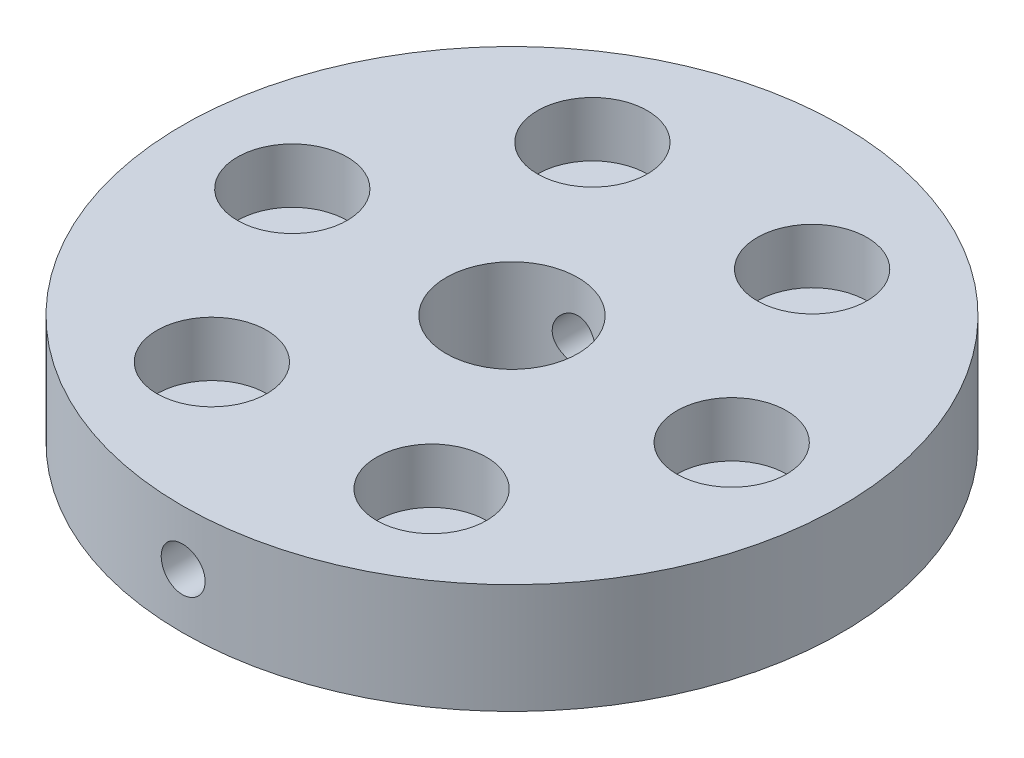
ISO-10303-21;
HEADER;
FILE_DESCRIPTION(('STEP AP214'),'2;1');
FILE_NAME('part.step','',(''),(''),'','','');
FILE_SCHEMA(('AUTOMOTIVE_DESIGN { 1 0 10303 214 1 1 1 1 }'));
ENDSEC;
DATA;
#1=APPLICATION_CONTEXT('core data for automotive mechanical design processes');
#2=APPLICATION_PROTOCOL_DEFINITION('international standard','automotive_design',2000,#1);
#3=PRODUCT_CONTEXT('',#1,'mechanical');
#4=PRODUCT('Part','Part','',(#3));
#5=PRODUCT_RELATED_PRODUCT_CATEGORY('part','',(#4));
#6=PRODUCT_DEFINITION_FORMATION('','',#4);
#7=PRODUCT_DEFINITION_CONTEXT('part definition',#1,'design');
#8=PRODUCT_DEFINITION('design','',#6,#7);
#9=PRODUCT_DEFINITION_SHAPE('','',#8);
#10=(LENGTH_UNIT() NAMED_UNIT(*) SI_UNIT(.MILLI.,.METRE.));
#11=(NAMED_UNIT(*) PLANE_ANGLE_UNIT() SI_UNIT($,.RADIAN.));
#12=(NAMED_UNIT(*) SI_UNIT($,.STERADIAN.) SOLID_ANGLE_UNIT());
#13=UNCERTAINTY_MEASURE_WITH_UNIT(LENGTH_MEASURE(1.E-05),#10,'distance_accuracy_value','');
#14=(GEOMETRIC_REPRESENTATION_CONTEXT(3) GLOBAL_UNCERTAINTY_ASSIGNED_CONTEXT((#13)) GLOBAL_UNIT_ASSIGNED_CONTEXT((#10,
#11,#12)) REPRESENTATION_CONTEXT('',''));
#15=CARTESIAN_POINT('',(0.,0.,0.));
#16=DIRECTION('',(0.,0.,1.));
#17=DIRECTION('',(1.,0.,0.));
#18=AXIS2_PLACEMENT_3D('',#15,#16,#17);
#19=CARTESIAN_POINT('',(20.,10.,0.));
#20=DIRECTION('',(0.,-1.,0.));
#21=DIRECTION('',(0.,0.,-1.));
#22=AXIS2_PLACEMENT_3D('',#19,#20,#21);
#23=CYLINDRICAL_SURFACE('',#22,2.);
#24=CARTESIAN_POINT('',(20.,0.,0.));
#25=DIRECTION('',(0.,1.,0.));
#26=DIRECTION('',(0.,0.,1.));
#27=AXIS2_PLACEMENT_3D('',#24,#25,#26);
#28=CIRCLE('',#27,2.);
#29=CARTESIAN_POINT('',(20.,0.,2.));
#30=VERTEX_POINT('',#29);
#31=EDGE_CURVE('E45',#30,#30,#28,.T.);
#32=ORIENTED_EDGE('',*,*,#31,.F.);
#33=EDGE_LOOP('',(#32));
#34=FACE_BOUND('',#33,.T.);
#35=CARTESIAN_POINT('',(20.,5.,0.));
#36=DIRECTION('',(0.,1.,0.));
#37=DIRECTION('',(0.,0.,1.));
#38=AXIS2_PLACEMENT_3D('',#35,#36,#37);
#39=CIRCLE('',#38,2.);
#40=CARTESIAN_POINT('',(20.,5.,2.));
#41=VERTEX_POINT('',#40);
#42=EDGE_CURVE('E36',#41,#41,#39,.T.);
#43=ORIENTED_EDGE('',*,*,#42,.T.);
#44=EDGE_LOOP('',(#43));
#45=FACE_BOUND('',#44,.T.);
#46=ADVANCED_FACE('F31',(#34,#45),#23,.F.);
#47=CARTESIAN_POINT('',(9.99999999999996,10.,17.3205080756888));
#48=DIRECTION('',(0.,-1.,0.));
#49=DIRECTION('',(0.,0.,-1.));
#50=AXIS2_PLACEMENT_3D('',#47,#48,#49);
#51=CYLINDRICAL_SURFACE('',#50,2.);
#52=CARTESIAN_POINT('',(9.99999999999996,0.,17.3205080756888));
#53=DIRECTION('',(0.,1.,0.));
#54=DIRECTION('',(0.,0.,1.));
#55=AXIS2_PLACEMENT_3D('',#52,#53,#54);
#56=CIRCLE('',#55,2.);
#57=CARTESIAN_POINT('',(9.99999999999996,0.,19.3205080756888));
#58=VERTEX_POINT('',#57);
#59=EDGE_CURVE('E106',#58,#58,#56,.T.);
#60=ORIENTED_EDGE('',*,*,#59,.F.);
#61=EDGE_LOOP('',(#60));
#62=FACE_BOUND('',#61,.T.);
#63=CARTESIAN_POINT('',(9.99999999999996,5.,17.3205080756888));
#64=DIRECTION('',(0.,1.,0.));
#65=DIRECTION('',(0.,0.,1.));
#66=AXIS2_PLACEMENT_3D('',#63,#64,#65);
#67=CIRCLE('',#66,2.);
#68=CARTESIAN_POINT('',(9.99999999999996,5.,19.3205080756888));
#69=VERTEX_POINT('',#68);
#70=EDGE_CURVE('E367',#69,#69,#67,.T.);
#71=ORIENTED_EDGE('',*,*,#70,.T.);
#72=EDGE_LOOP('',(#71));
#73=FACE_BOUND('',#72,.T.);
#74=ADVANCED_FACE('F129',(#62,#73),#51,.F.);
#75=CARTESIAN_POINT('',(-10.0000000000001,10.,17.3205080756887));
#76=DIRECTION('',(0.,-1.,0.));
#77=DIRECTION('',(0.,0.,-1.));
#78=AXIS2_PLACEMENT_3D('',#75,#76,#77);
#79=CYLINDRICAL_SURFACE('',#78,2.);
#80=CARTESIAN_POINT('',(-10.0000000000001,0.,17.3205080756887));
#81=DIRECTION('',(0.,1.,0.));
#82=DIRECTION('',(0.,0.,1.));
#83=AXIS2_PLACEMENT_3D('',#80,#81,#82);
#84=CIRCLE('',#83,2.);
#85=CARTESIAN_POINT('',(-10.0000000000001,0.,19.3205080756887));
#86=VERTEX_POINT('',#85);
#87=EDGE_CURVE('E103',#86,#86,#84,.T.);
#88=ORIENTED_EDGE('',*,*,#87,.F.);
#89=EDGE_LOOP('',(#88));
#90=FACE_BOUND('',#89,.T.);
#91=CARTESIAN_POINT('',(-10.0000000000001,5.,17.3205080756887));
#92=DIRECTION('',(0.,1.,0.));
#93=DIRECTION('',(0.,0.,1.));
#94=AXIS2_PLACEMENT_3D('',#91,#92,#93);
#95=CIRCLE('',#94,2.);
#96=CARTESIAN_POINT('',(-10.0000000000001,5.,19.3205080756887));
#97=VERTEX_POINT('',#96);
#98=EDGE_CURVE('E369',#97,#97,#95,.T.);
#99=ORIENTED_EDGE('',*,*,#98,.T.);
#100=EDGE_LOOP('',(#99));
#101=FACE_BOUND('',#100,.T.);
#102=ADVANCED_FACE('F134',(#90,#101),#79,.F.);
#103=CARTESIAN_POINT('',(-20.,10.,-1.39659253553725E-13));
#104=DIRECTION('',(0.,-1.,0.));
#105=DIRECTION('',(0.,0.,-1.));
#106=AXIS2_PLACEMENT_3D('',#103,#104,#105);
#107=CYLINDRICAL_SURFACE('',#106,2.);
#108=CARTESIAN_POINT('',(-20.,0.,-1.39659253553725E-13));
#109=DIRECTION('',(0.,1.,0.));
#110=DIRECTION('',(0.,0.,1.));
#111=AXIS2_PLACEMENT_3D('',#108,#109,#110);
#112=CIRCLE('',#111,2.);
#113=CARTESIAN_POINT('',(-20.,0.,1.99999999999986));
#114=VERTEX_POINT('',#113);
#115=EDGE_CURVE('E100',#114,#114,#112,.T.);
#116=ORIENTED_EDGE('',*,*,#115,.F.);
#117=EDGE_LOOP('',(#116));
#118=FACE_BOUND('',#117,.T.);
#119=CARTESIAN_POINT('',(-20.,5.,-1.39659253553725E-13));
#120=DIRECTION('',(0.,1.,0.));
#121=DIRECTION('',(0.,0.,1.));
#122=AXIS2_PLACEMENT_3D('',#119,#120,#121);
#123=CIRCLE('',#122,2.);
#124=CARTESIAN_POINT('',(-20.,5.,1.99999999999986));
#125=VERTEX_POINT('',#124);
#126=EDGE_CURVE('E373',#125,#125,#123,.T.);
#127=ORIENTED_EDGE('',*,*,#126,.T.);
#128=EDGE_LOOP('',(#127));
#129=FACE_BOUND('',#128,.T.);
#130=ADVANCED_FACE('F196',(#118,#129),#107,.F.);
#131=CARTESIAN_POINT('',(10.0000000000002,10.,-17.3205080756887));
#132=DIRECTION('',(0.,-1.,0.));
#133=DIRECTION('',(0.,0.,-1.));
#134=AXIS2_PLACEMENT_3D('',#131,#132,#133);
#135=CYLINDRICAL_SURFACE('',#134,2.);
#136=CARTESIAN_POINT('',(10.0000000000002,0.,-17.3205080756887));
#137=DIRECTION('',(0.,1.,0.));
#138=DIRECTION('',(0.,0.,1.));
#139=AXIS2_PLACEMENT_3D('',#136,#137,#138);
#140=CIRCLE('',#139,2.);
#141=CARTESIAN_POINT('',(10.0000000000002,0.,-15.3205080756887));
#142=VERTEX_POINT('',#141);
#143=EDGE_CURVE('E94',#142,#142,#140,.T.);
#144=ORIENTED_EDGE('',*,*,#143,.F.);
#145=EDGE_LOOP('',(#144));
#146=FACE_BOUND('',#145,.T.);
#147=CARTESIAN_POINT('',(10.0000000000002,5.,-17.3205080756887));
#148=DIRECTION('',(0.,1.,0.));
#149=DIRECTION('',(0.,0.,1.));
#150=AXIS2_PLACEMENT_3D('',#147,#148,#149);
#151=CIRCLE('',#150,2.);
#152=CARTESIAN_POINT('',(10.0000000000002,5.,-15.3205080756887));
#153=VERTEX_POINT('',#152);
#154=EDGE_CURVE('E378',#153,#153,#151,.T.);
#155=ORIENTED_EDGE('',*,*,#154,.T.);
#156=EDGE_LOOP('',(#155));
#157=FACE_BOUND('',#156,.T.);
#158=ADVANCED_FACE('F75',(#146,#157),#135,.F.);
#159=CARTESIAN_POINT('',(-9.99999999999984,10.,-17.3205080756889));
#160=DIRECTION('',(0.,-1.,0.));
#161=DIRECTION('',(0.,0.,-1.));
#162=AXIS2_PLACEMENT_3D('',#159,#160,#161);
#163=CYLINDRICAL_SURFACE('',#162,2.);
#164=CARTESIAN_POINT('',(-9.99999999999984,0.,-17.3205080756889));
#165=DIRECTION('',(0.,1.,0.));
#166=DIRECTION('',(0.,0.,1.));
#167=AXIS2_PLACEMENT_3D('',#164,#165,#166);
#168=CIRCLE('',#167,2.);
#169=CARTESIAN_POINT('',(-9.99999999999984,0.,-15.3205080756889));
#170=VERTEX_POINT('',#169);
#171=EDGE_CURVE('E97',#170,#170,#168,.T.);
#172=ORIENTED_EDGE('',*,*,#171,.F.);
#173=EDGE_LOOP('',(#172));
#174=FACE_BOUND('',#173,.T.);
#175=CARTESIAN_POINT('',(-9.99999999999984,5.,-17.3205080756889));
#176=DIRECTION('',(0.,1.,0.));
#177=DIRECTION('',(0.,0.,1.));
#178=AXIS2_PLACEMENT_3D('',#175,#176,#177);
#179=CIRCLE('',#178,2.);
#180=CARTESIAN_POINT('',(-9.99999999999984,5.,-15.3205080756889));
#181=VERTEX_POINT('',#180);
#182=EDGE_CURVE('E58',#181,#181,#179,.T.);
#183=ORIENTED_EDGE('',*,*,#182,.T.);
#184=EDGE_LOOP('',(#183));
#185=FACE_BOUND('',#184,.T.);
#186=ADVANCED_FACE('F141',(#174,#185),#163,.F.);
#187=CARTESIAN_POINT('',(0.,10.,0.));
#188=DIRECTION('',(0.,1.,0.));
#189=DIRECTION('',(0.,0.,1.));
#190=AXIS2_PLACEMENT_3D('',#187,#188,#189);
#191=PLANE('',#190);
#192=CARTESIAN_POINT('',(-19.9999999999993,10.,2.52802413706663E-13));
#193=DIRECTION('',(0.,1.,0.));
#194=DIRECTION('',(0.,0.,1.));
#195=AXIS2_PLACEMENT_3D('',#192,#193,#194);
#196=CIRCLE('',#195,5.00000000000049);
#197=CARTESIAN_POINT('',(-19.9999999999993,10.,5.00000000000074));
#198=VERTEX_POINT('',#197);
#199=EDGE_CURVE('E386',#198,#198,#196,.T.);
#200=ORIENTED_EDGE('',*,*,#199,.F.);
#201=EDGE_LOOP('',(#200));
#202=FACE_BOUND('',#201,.T.);
#203=CARTESIAN_POINT('',(-9.99999999999869,10.,17.3205080756887));
#204=DIRECTION('',(0.,1.,0.));
#205=DIRECTION('',(0.,0.,1.));
#206=AXIS2_PLACEMENT_3D('',#203,#204,#205);
#207=CIRCLE('',#206,5.00000000000125);
#208=CARTESIAN_POINT('',(-9.99999999999869,10.,22.3205080756899));
#209=VERTEX_POINT('',#208);
#210=EDGE_CURVE('E392',#209,#209,#207,.T.);
#211=ORIENTED_EDGE('',*,*,#210,.F.);
#212=EDGE_LOOP('',(#211));
#213=FACE_BOUND('',#212,.T.);
#214=CARTESIAN_POINT('',(10.0000000000013,10.,17.320508075688));
#215=DIRECTION('',(0.,1.,0.));
#216=DIRECTION('',(0.,0.,1.));
#217=AXIS2_PLACEMENT_3D('',#214,#215,#216);
#218=CIRCLE('',#217,5.00000000000178);
#219=CARTESIAN_POINT('',(10.0000000000013,10.,22.3205080756898));
#220=VERTEX_POINT('',#219);
#221=EDGE_CURVE('E398',#220,#220,#218,.T.);
#222=ORIENTED_EDGE('',*,*,#221,.F.);
#223=EDGE_LOOP('',(#222));
#224=FACE_BOUND('',#223,.T.);
#225=CARTESIAN_POINT('',(20.0000000000007,10.,-1.08893912912748E-12));
#226=DIRECTION('',(0.,1.,0.));
#227=DIRECTION('',(0.,0.,1.));
#228=AXIS2_PLACEMENT_3D('',#225,#226,#227);
#229=CIRCLE('',#228,5.00000000000149);
#230=CARTESIAN_POINT('',(20.0000000000007,10.,5.0000000000004));
#231=VERTEX_POINT('',#230);
#232=EDGE_CURVE('E350',#231,#231,#229,.T.);
#233=ORIENTED_EDGE('',*,*,#232,.F.);
#234=EDGE_LOOP('',(#233));
#235=FACE_BOUND('',#234,.T.);
#236=CARTESIAN_POINT('',(10.0000000000001,10.,-17.3205080756895));
#237=DIRECTION('',(0.,1.,0.));
#238=DIRECTION('',(0.,0.,1.));
#239=AXIS2_PLACEMENT_3D('',#236,#237,#238);
#240=CIRCLE('',#239,5.00000000000063);
#241=CARTESIAN_POINT('',(10.0000000000001,10.,-12.3205080756889));
#242=VERTEX_POINT('',#241);
#243=EDGE_CURVE('E349',#242,#242,#240,.T.);
#244=ORIENTED_EDGE('',*,*,#243,.F.);
#245=EDGE_LOOP('',(#244));
#246=FACE_BOUND('',#245,.T.);
#247=CARTESIAN_POINT('',(-9.99999999999984,10.,-17.3205080756889));
#248=DIRECTION('',(0.,1.,0.));
#249=DIRECTION('',(0.,0.,1.));
#250=AXIS2_PLACEMENT_3D('',#247,#248,#249);
#251=CIRCLE('',#250,5.);
#252=CARTESIAN_POINT('',(-9.99999999999984,10.,-12.3205080756889));
#253=VERTEX_POINT('',#252);
#254=EDGE_CURVE('E88',#253,#253,#251,.T.);
#255=ORIENTED_EDGE('',*,*,#254,.F.);
#256=EDGE_LOOP('',(#255));
#257=FACE_BOUND('',#256,.T.);
#258=CARTESIAN_POINT('',(0.,10.,0.));
#259=DIRECTION('',(0.,1.,0.));
#260=DIRECTION('',(0.,0.,1.));
#261=AXIS2_PLACEMENT_3D('',#258,#259,#260);
#262=CIRCLE('',#261,6.);
#263=CARTESIAN_POINT('',(0.,10.,6.));
#264=VERTEX_POINT('',#263);
#265=EDGE_CURVE('E110',#264,#264,#262,.T.);
#266=ORIENTED_EDGE('',*,*,#265,.F.);
#267=EDGE_LOOP('',(#266));
#268=FACE_BOUND('',#267,.T.);
#269=CARTESIAN_POINT('',(0.,10.,0.));
#270=DIRECTION('',(0.,1.,0.));
#271=DIRECTION('',(0.,0.,1.));
#272=AXIS2_PLACEMENT_3D('',#269,#270,#271);
#273=CIRCLE('',#272,30.);
#274=CARTESIAN_POINT('',(0.,10.,30.));
#275=VERTEX_POINT('',#274);
#276=EDGE_CURVE('E10',#275,#275,#273,.T.);
#277=ORIENTED_EDGE('',*,*,#276,.T.);
#278=EDGE_LOOP('',(#277));
#279=FACE_BOUND('',#278,.T.);
#280=ADVANCED_FACE('F139',(#202,#213,#224,#235,#246,#257,#268,#279),#191,.T.);
#281=CARTESIAN_POINT('',(0.,0.,0.));
#282=DIRECTION('',(0.,1.,0.));
#283=DIRECTION('',(0.,0.,1.));
#284=AXIS2_PLACEMENT_3D('',#281,#282,#283);
#285=PLANE('',#284);
#286=CARTESIAN_POINT('',(0.,0.,0.));
#287=DIRECTION('',(0.,1.,0.));
#288=DIRECTION('',(0.,0.,1.));
#289=AXIS2_PLACEMENT_3D('',#286,#287,#288);
#290=CIRCLE('',#289,30.);
#291=CARTESIAN_POINT('',(0.,0.,30.));
#292=VERTEX_POINT('',#291);
#293=EDGE_CURVE('E40',#292,#292,#290,.T.);
#294=ORIENTED_EDGE('',*,*,#293,.F.);
#295=EDGE_LOOP('',(#294));
#296=FACE_BOUND('',#295,.T.);
#297=ORIENTED_EDGE('',*,*,#31,.T.);
#298=EDGE_LOOP('',(#297));
#299=FACE_BOUND('',#298,.T.);
#300=CARTESIAN_POINT('',(0.,0.,0.));
#301=DIRECTION('',(0.,1.,0.));
#302=DIRECTION('',(0.,0.,1.));
#303=AXIS2_PLACEMENT_3D('',#300,#301,#302);
#304=CIRCLE('',#303,6.);
#305=CARTESIAN_POINT('',(0.,0.,6.));
#306=VERTEX_POINT('',#305);
#307=EDGE_CURVE('E109',#306,#306,#304,.T.);
#308=ORIENTED_EDGE('',*,*,#307,.T.);
#309=EDGE_LOOP('',(#308));
#310=FACE_BOUND('',#309,.T.);
#311=ORIENTED_EDGE('',*,*,#59,.T.);
#312=EDGE_LOOP('',(#311));
#313=FACE_BOUND('',#312,.T.);
#314=ORIENTED_EDGE('',*,*,#87,.T.);
#315=EDGE_LOOP('',(#314));
#316=FACE_BOUND('',#315,.T.);
#317=ORIENTED_EDGE('',*,*,#115,.T.);
#318=EDGE_LOOP('',(#317));
#319=FACE_BOUND('',#318,.T.);
#320=ORIENTED_EDGE('',*,*,#171,.T.);
#321=EDGE_LOOP('',(#320));
#322=FACE_BOUND('',#321,.T.);
#323=ORIENTED_EDGE('',*,*,#143,.T.);
#324=EDGE_LOOP('',(#323));
#325=FACE_BOUND('',#324,.T.);
#326=ADVANCED_FACE('F115',(#296,#299,#310,#313,#316,#319,#322,#325),#285,.F.);
#327=CARTESIAN_POINT('',(0.,10.,0.));
#328=DIRECTION('',(0.,-1.,0.));
#329=DIRECTION('',(0.,0.,-1.));
#330=AXIS2_PLACEMENT_3D('',#327,#328,#329);
#331=CYLINDRICAL_SURFACE('',#330,30.);
#332=CARTESIAN_POINT('',(0.,7.,-30.));
#333=CARTESIAN_POINT('',(-0.11220718160825,6.99999506890353,-29.9999991159693));
#334=CARTESIAN_POINT('',(-0.224492544095489,6.99052542474135,-29.9993637488104));
#335=CARTESIAN_POINT('',(-0.445961706921855,6.95288568053087,-29.99689022742));
#336=CARTESIAN_POINT('',(-0.55514176136416,6.92469391739945,-29.9950506798848));
#337=CARTESIAN_POINT('',(-0.767160334719392,6.85042424975783,-29.9903768602104));
#338=CARTESIAN_POINT('',(-0.870002208064346,6.80435590214166,-29.9875431196483));
#339=CARTESIAN_POINT('',(-1.06646693056598,6.69565656565758,-29.981199465711));
#340=CARTESIAN_POINT('',(-1.16009185969707,6.63302932542316,-29.9776897054232));
#341=CARTESIAN_POINT('',(-1.33564919891769,6.49287479883462,-29.9703817950545));
#342=CARTESIAN_POINT('',(-1.41756401335717,6.41532549231292,-29.9665832238557));
#343=CARTESIAN_POINT('',(-1.56722526875503,6.24757385641069,-29.9591293956655));
#344=CARTESIAN_POINT('',(-1.63497111245221,6.15737099391553,-29.9554741447207));
#345=CARTESIAN_POINT('',(-1.7544269206534,5.96677141734112,-29.9487158673442));
#346=CARTESIAN_POINT('',(-1.80612205865276,5.86636539124135,-29.9456133526116));
#347=CARTESIAN_POINT('',(-1.8919141947832,5.65827485100644,-29.9403159453719));
#348=CARTESIAN_POINT('',(-1.92601140358944,5.55059042402277,-29.9381210419993));
#349=CARTESIAN_POINT('',(-1.97559039878578,5.33117111078043,-29.9348904352705));
#350=CARTESIAN_POINT('',(-1.99110003285512,5.2194425427993,-29.9338529979741));
#351=CARTESIAN_POINT('',(-2.00314959501607,4.99496340454772,-29.9330491260886));
#352=CARTESIAN_POINT('',(-1.99968976291517,4.882212847215,-29.9332826754319));
#353=CARTESIAN_POINT('',(-1.97392169354549,4.65908024796942,-29.9349928300971));
#354=CARTESIAN_POINT('',(-1.95164361348918,4.54869470604136,-29.9364674465313));
#355=CARTESIAN_POINT('',(-1.8889182311827,4.33323341914305,-29.940490431565));
#356=CARTESIAN_POINT('',(-1.84847080784418,4.22815770956502,-29.9430388073205));
#357=CARTESIAN_POINT('',(-1.75052074022152,4.0262020510792,-29.9489244249794));
#358=CARTESIAN_POINT('',(-1.69300444234876,3.92932874340512,-29.9522622979751));
#359=CARTESIAN_POINT('',(-1.56255918584644,3.74660037497756,-29.9593501446415));
#360=CARTESIAN_POINT('',(-1.4896300292949,3.66074545573787,-29.9631001236037));
#361=CARTESIAN_POINT('',(-1.33025952166558,3.50231553054486,-29.9705984347621));
#362=CARTESIAN_POINT('',(-1.24379207639662,3.42976677027605,-29.9743467494597));
#363=CARTESIAN_POINT('',(-1.0598908833137,3.30021108589366,-29.9814123135959));
#364=CARTESIAN_POINT('',(-0.962457131153558,3.24320416793967,-29.9847295628637));
#365=CARTESIAN_POINT('',(-0.759372989467657,3.14635250253145,-29.9905595238454));
#366=CARTESIAN_POINT('',(-0.653722110181593,3.10650877897124,-29.9930721875582));
#367=CARTESIAN_POINT('',(-0.4372099921606,3.04513220086321,-29.9970092188693));
#368=CARTESIAN_POINT('',(-0.326348822663408,3.02359910306441,-29.9984336009249));
#369=CARTESIAN_POINT('',(-0.102790742249202,2.99948761148684,-30.0000317068719));
#370=CARTESIAN_POINT('',(0.00990223929368827,2.99687293683854,-30.0002078246131));
#371=CARTESIAN_POINT('',(0.234125143351199,3.01057767254387,-29.9992959286395));
#372=CARTESIAN_POINT('',(0.345655072760979,3.02689697058289,-29.9982079224235));
#373=CARTESIAN_POINT('',(0.564283521058741,3.07797636070958,-29.9948917787279));
#374=CARTESIAN_POINT('',(0.671385953017915,3.11271977675522,-29.9926646723355));
#375=CARTESIAN_POINT('',(0.878240016028388,3.19964421137158,-29.987320817485));
#376=CARTESIAN_POINT('',(0.977991571945708,3.2518254081453,-29.9842040599351));
#377=CARTESIAN_POINT('',(1.16747826276657,3.37223631972177,-29.9774249977385));
#378=CARTESIAN_POINT('',(1.257197992027,3.4404902310537,-29.9737618736473));
#379=CARTESIAN_POINT('',(1.42391905529297,3.59107392180793,-29.9663049547009));
#380=CARTESIAN_POINT('',(1.5009202472409,3.67340385842918,-29.9625111583868));
#381=CARTESIAN_POINT('',(1.64014163096899,3.84995924692014,-29.9552135175063));
#382=CARTESIAN_POINT('',(1.70233826071324,3.94420330043452,-29.9517101408526));
#383=CARTESIAN_POINT('',(1.81002374821476,4.14181835113973,-29.9453959088784));
#384=CARTESIAN_POINT('',(1.85551272047443,4.24518928577538,-29.9425850488119));
#385=CARTESIAN_POINT('',(1.92845094345579,4.4580381825985,-29.9379762292465));
#386=CARTESIAN_POINT('',(1.95591495182968,4.56751106903048,-29.9361774413024));
#387=CARTESIAN_POINT('',(1.99207181640005,4.78952666310999,-29.9337933328598));
#388=CARTESIAN_POINT('',(2.0007648895608,4.90206933526011,-29.9332079983357));
#389=CARTESIAN_POINT('',(1.99913096706958,5.1267955792723,-29.9333171483457));
#390=CARTESIAN_POINT('',(1.98884100927818,5.2389794235129,-29.9340091406842));
#391=CARTESIAN_POINT('',(1.94960998852362,5.46002253493527,-29.9365896850794));
#392=CARTESIAN_POINT('',(1.92066889256042,5.56888179623439,-29.9384782392531));
#393=CARTESIAN_POINT('',(1.84496567556568,5.78019058852793,-29.9432384721073));
#394=CARTESIAN_POINT('',(1.79820380933836,5.882640211144,-29.946110136731));
#395=CARTESIAN_POINT('',(1.68819129475054,6.078239483837,-29.9525129626311));
#396=CARTESIAN_POINT('',(1.62494104348057,6.1713893578055,-29.9560441080244));
#397=CARTESIAN_POINT('',(1.48360954988726,6.34593327799912,-29.9633760591776));
#398=CARTESIAN_POINT('',(1.405501349166,6.4273054746638,-29.9671773471093));
#399=CARTESIAN_POINT('',(1.23671085310942,6.57581201853442,-29.9746170427063));
#400=CARTESIAN_POINT('',(1.14602549222661,6.64294288444753,-29.9782554103747));
#401=CARTESIAN_POINT('',(0.954539197677785,6.76111763509167,-29.9849635491124));
#402=CARTESIAN_POINT('',(0.853724815941026,6.8121397503877,-29.988032548446));
#403=CARTESIAN_POINT('',(0.645012430838708,6.89647005846328,-29.9932460872511));
#404=CARTESIAN_POINT('',(0.537122862766896,6.92979892940716,-29.9953917053239));
#405=CARTESIAN_POINT('',(0.357147747544227,6.96916497917641,-29.9979564755538));
#406=CARTESIAN_POINT('',(0.286224568323956,6.98071308663501,-29.9987193769133));
#407=CARTESIAN_POINT('',(0.143544925639314,6.99613216834521,-29.9997414215294));
#408=CARTESIAN_POINT('',(0.0717884635041453,7.0000031548412,-30.0000005655895));
#409=CARTESIAN_POINT('',(0.,7.,-30.));
#410=B_SPLINE_CURVE_WITH_KNOTS('',3,(#332,#333,#334,#335,#336,#337,#338,#339,#340,#341,#342,
#343,#344,#345,#346,#347,#348,#349,#350,#351,#352,#353,#354,#355,#356,#357,#358,#359,#360,#361,
#362,#363,#364,#365,#366,#367,#368,#369,#370,#371,#372,#373,#374,#375,#376,#377,#378,#379,#380,
#381,#382,#383,#384,#385,#386,#387,#388,#389,#390,#391,#392,#393,#394,#395,#396,#397,#398,#399,
#400,#401,#402,#403,#404,#405,#406,#407,#408,#409),.UNSPECIFIED.,.T.,.F.,(4,2,2,2,2,2,2,2,2,2,2,
2,2,2,2,2,2,2,2,2,2,2,2,2,2,2,2,2,2,2,2,2,2,2,2,2,2,2,4),(0.,0.336359468088583,
0.673108812368924,1.0096783765665,1.34617181264793,1.68316566657447,2.02017372285988,
2.35749216346331,2.69480656573562,3.03161497336782,3.36841912315786,3.70468454869627,
4.04095221528629,4.37748959461817,4.71403129580847,5.05122983149148,5.3884285008139,
5.72564728340282,6.06286158607481,6.39942902305926,6.73599446356633,7.07225579053967,
7.40852055399434,7.74529481764797,8.08207284259232,8.41938333164891,8.75669150897612,
9.09372317494685,9.43075094530865,9.76712183491319,10.1034933196707,10.4398599951155,
10.7762185705748,11.1131933619556,11.4502504321364,11.7877610720723,12.1248763887431,
12.3400744497337,12.5552721675006),.UNSPECIFIED.);
#411=CARTESIAN_POINT('',(0.,7.,-30.));
#412=VERTEX_POINT('',#411);
#413=EDGE_CURVE('E87',#412,#412,#410,.T.);
#414=ORIENTED_EDGE('',*,*,#413,.T.);
#415=EDGE_LOOP('',(#414));
#416=FACE_BOUND('',#415,.T.);
#417=CARTESIAN_POINT('',(2.,5.,29.9332590941915));
#418=CARTESIAN_POINT('',(1.99999506862064,4.88779313084131,29.9332599855708));
#419=CARTESIAN_POINT('',(1.99052547541233,4.77550807976003,29.9338968030658));
#420=CARTESIAN_POINT('',(1.95288595200553,4.55403956398372,29.9363755063483));
#421=CARTESIAN_POINT('',(1.92469435766,4.44485984542947,29.9382187881592));
#422=CARTESIAN_POINT('',(1.85042518382539,4.23284198214024,29.9429007108597));
#423=CARTESIAN_POINT('',(1.80435716927576,4.1300004801283,29.9457388193798));
#424=CARTESIAN_POINT('',(1.69565861700517,3.93353637914274,29.9520899351243));
#425=CARTESIAN_POINT('',(1.63303182709335,3.83991170066325,29.9556027895818));
#426=CARTESIAN_POINT('',(1.4928777542475,3.6643540756608,29.9629142920061));
#427=CARTESIAN_POINT('',(1.41532835065139,3.58243880483549,29.9667133590911));
#428=CARTESIAN_POINT('',(1.2475763293488,3.4327766693943,29.9741653354667));
#429=CARTESIAN_POINT('',(1.15737317976858,3.36503040064111,29.9778182386054));
#430=CARTESIAN_POINT('',(0.966773354390772,3.2455741501043,29.9845699850437));
#431=CARTESIAN_POINT('',(0.866367415917219,3.19387891616132,29.9876683176985));
#432=CARTESIAN_POINT('',(0.658277066207778,3.10808657843804,29.9929573809877));
#433=CARTESIAN_POINT('',(0.550592741645009,3.07398926513837,29.9951481224277));
#434=CARTESIAN_POINT('',(0.331173730869926,3.02441004841046,29.9983722604794));
#435=CARTESIAN_POINT('',(0.21944536469522,3.00890028925079,29.9994073887595));
#436=CARTESIAN_POINT('',(-0.00503337924579405,2.99685040699982,30.0002095058559));
#437=CARTESIAN_POINT('',(-0.117783744146027,3.00031004543051,29.9999765106147));
#438=CARTESIAN_POINT('',(-0.340917203777746,3.02607781051085,29.9982700759238));
#439=CARTESIAN_POINT('',(-0.451303775771714,3.04835597483585,29.9967986083482));
#440=CARTESIAN_POINT('',(-0.666767079374352,3.11108188364424,29.9927831335216));
#441=CARTESIAN_POINT('',(-0.771843776142261,3.15152974733096,29.9902391192341));
#442=CARTESIAN_POINT('',(-0.973800622218297,3.24948072189035,29.9843615518826));
#443=CARTESIAN_POINT('',(-1.07067418064394,3.30699738281159,29.9810273719715));
#444=CARTESIAN_POINT('',(-1.25340289614341,3.43744341158939,29.9739446132401));
#445=CARTESIAN_POINT('',(-1.33925791154814,3.51037297758292,29.9701960290928));
#446=CARTESIAN_POINT('',(-1.49768736553507,3.66974377275744,29.9626976235342));
#447=CARTESIAN_POINT('',(-1.57023564135122,3.75621101327545,29.9589478139045));
#448=CARTESIAN_POINT('',(-1.69979044626968,3.94011162513962,29.9518769959626));
#449=CARTESIAN_POINT('',(-1.75679696823215,4.03754500152355,29.9485559878474));
#450=CARTESIAN_POINT('',(-1.85364834983682,4.24062904755692,29.9427178724309));
#451=CARTESIAN_POINT('',(-1.89349206223081,4.34628026597099,29.9402008188729));
#452=CARTESIAN_POINT('',(-1.95486851381449,4.56279312020444,29.9362563316271));
#453=CARTESIAN_POINT('',(-1.97640149827573,4.67365468621041,29.934828883344));
#454=CARTESIAN_POINT('',(-2.00051256331621,4.89721294127368,29.9332273280892));
#455=CARTESIAN_POINT('',(-2.00312703218022,5.00990568931816,29.933050815055));
#456=CARTESIAN_POINT('',(-1.98942196827456,5.23412807672454,29.9339647486092));
#457=CARTESIAN_POINT('',(-1.97310254780639,5.34565772298112,29.9350551876831));
#458=CARTESIAN_POINT('',(-1.9220232001262,5.5642848124218,29.9383779477343));
#459=CARTESIAN_POINT('',(-1.88728007110511,5.67138619742669,29.9406092284597));
#460=CARTESIAN_POINT('',(-1.80035656178918,5.87823829377852,29.9459613535974));
#461=CARTESIAN_POINT('',(-1.74817600160984,5.97798892928218,29.9490822071865));
#462=CARTESIAN_POINT('',(-1.62776601842824,6.16747500810696,29.9558676337388));
#463=CARTESIAN_POINT('',(-1.55951223698075,6.25719494284718,29.9595330287937));
#464=CARTESIAN_POINT('',(-1.40892868901806,6.42391648133143,29.9669916366522));
#465=CARTESIAN_POINT('',(-1.32659876627837,6.50091794390046,29.9707848508741));
#466=CARTESIAN_POINT('',(-1.15004325655493,6.64013989087835,29.9780787268703));
#467=CARTESIAN_POINT('',(-1.05579906607295,6.70233681119619,29.9815789165792));
#468=CARTESIAN_POINT('',(-0.858183665994072,6.81002280896695,29.9878855641531));
#469=CARTESIAN_POINT('',(-0.754812518971178,6.85551200095627,29.9906920267738));
#470=CARTESIAN_POINT('',(-0.541963773709555,6.92845037406462,29.9952927635916));
#471=CARTESIAN_POINT('',(-0.432491283895298,6.95591440793339,29.9970878709734));
#472=CARTESIAN_POINT('',(-0.210476524547507,6.99207145796256,29.9994669667668));
#473=CARTESIAN_POINT('',(-0.0979342901666959,7.00076468898271,30.0000509690414));
#474=CARTESIAN_POINT('',(0.12679224206348,6.9991312178269,29.9999420914854));
#475=CARTESIAN_POINT('',(0.238976810814923,6.98884136490353,29.999251685487));
#476=CARTESIAN_POINT('',(0.460021396901178,6.94961029858176,29.9966765222352));
#477=CARTESIAN_POINT('',(0.568881408584167,6.92066905347742,29.9947917629514));
#478=CARTESIAN_POINT('',(0.780191672357135,6.84496526523624,29.9900396681863));
#479=CARTESIAN_POINT('',(0.882642015306007,6.79820297478449,29.9871723466368));
#480=CARTESIAN_POINT('',(1.07824255098349,6.68818938949287,29.9807768572796));
#481=CARTESIAN_POINT('',(1.17139296804729,6.62493849252834,29.9772487054185));
#482=CARTESIAN_POINT('',(1.34593683215351,6.48360629898129,29.9699201247702));
#483=CARTESIAN_POINT('',(1.42730854840346,6.40549819094535,29.9661192115991));
#484=CARTESIAN_POINT('',(1.5758141663933,6.2367080764908,29.9586774419486));
#485=CARTESIAN_POINT('',(1.64294458559714,6.14602300347355,29.955036624791));
#486=CARTESIAN_POINT('',(1.76111886715276,5.95453693307722,29.9483218123428));
#487=CARTESIAN_POINT('',(1.81214087671894,5.8537224362285,29.9452485893789));
#488=CARTESIAN_POINT('',(1.89647095501993,5.64500980492943,29.9400267155395));
#489=CARTESIAN_POINT('',(1.92979970351108,5.53712010644503,29.9378769858551));
#490=CARTESIAN_POINT('',(1.9691654006181,5.35714532009373,29.9353070401504));
#491=CARTESIAN_POINT('',(1.98071334953096,5.28622262509592,29.934542509556));
#492=CARTESIAN_POINT('',(1.99613222055786,5.14354395301947,29.9335182518378));
#493=CARTESIAN_POINT('',(2.0000031550096,5.07178797728017,29.9332585239028));
#494=CARTESIAN_POINT('',(2.,5.,29.9332590941915));
#495=B_SPLINE_CURVE_WITH_KNOTS('',3,(#417,#418,#419,#420,#421,#422,#423,#424,#425,#426,#427,
#428,#429,#430,#431,#432,#433,#434,#435,#436,#437,#438,#439,#440,#441,#442,#443,#444,#445,#446,
#447,#448,#449,#450,#451,#452,#453,#454,#455,#456,#457,#458,#459,#460,#461,#462,#463,#464,#465,
#466,#467,#468,#469,#470,#471,#472,#473,#474,#475,#476,#477,#478,#479,#480,#481,#482,#483,#484,
#485,#486,#487,#488,#489,#490,#491,#492,#493,#494),.UNSPECIFIED.,.T.,.F.,(4,2,2,2,2,2,2,2,2,2,2,
2,2,2,2,2,2,2,2,2,2,2,2,2,2,2,2,2,2,2,2,2,2,2,2,2,2,2,4),(0.,0.336358529681879,
0.673106956106879,1.00967545014955,1.34616783250628,1.68316291414501,2.02017216491389,
2.35749015283577,2.69480412458531,3.03161195528034,3.36841555173035,3.70468390759002,
4.04095446958914,4.37749269702237,4.71403525100681,5.05123255953421,5.38843002296879,
5.72565002287535,6.0628655056609,6.39943220801483,6.73599691411995,7.07225527681288,
7.40851710845334,7.74529185116234,8.08207033181848,8.41938132413802,8.75669000404804,
9.09372039111905,9.43074692035566,9.7671199145687,10.1034934805917,10.4398622773421,
10.7762229581571,11.1131964982303,11.4502523463419,11.7877635013936,12.1248793024519,
12.3400759073805,12.5552721664673),.UNSPECIFIED.);
#496=CARTESIAN_POINT('',(2.,5.,29.9332590941915));
#497=VERTEX_POINT('',#496);
#498=EDGE_CURVE('E82',#497,#497,#495,.T.);
#499=ORIENTED_EDGE('',*,*,#498,.T.);
#500=EDGE_LOOP('',(#499));
#501=FACE_BOUND('',#500,.T.);
#502=ORIENTED_EDGE('',*,*,#276,.F.);
#503=EDGE_LOOP('',(#502));
#504=FACE_BOUND('',#503,.T.);
#505=ORIENTED_EDGE('',*,*,#293,.T.);
#506=EDGE_LOOP('',(#505));
#507=FACE_BOUND('',#506,.T.);
#508=ADVANCED_FACE('F33',(#416,#501,#504,#507),#331,.T.);
#509=CARTESIAN_POINT('',(0.,10.,0.));
#510=DIRECTION('',(0.,-1.,0.));
#511=DIRECTION('',(0.,0.,-1.));
#512=AXIS2_PLACEMENT_3D('',#509,#510,#511);
#513=CYLINDRICAL_SURFACE('',#512,6.);
#514=CARTESIAN_POINT('',(0.,7.,-6.));
#515=CARTESIAN_POINT('',(-0.109126725773446,7.00000050746328,-6.00000030601888));
#516=CARTESIAN_POINT('',(-0.2182503890771,6.99103946774557,-5.9969953901509));
#517=CARTESIAN_POINT('',(-0.433283521745944,6.95554178236556,-5.98530420406562));
#518=CARTESIAN_POINT('',(-0.539192656237635,6.92900331210216,-5.97661734404305));
#519=CARTESIAN_POINT('',(-0.744665579003552,6.8593615132319,-5.95450615812885));
#520=CARTESIAN_POINT('',(-0.844239651772068,6.81628587508146,-5.94108975461707));
#521=CARTESIAN_POINT('',(-1.03474987361065,6.71491765432331,-5.91088891434684));
#522=CARTESIAN_POINT('',(-1.12568431391741,6.6566220699948,-5.89410381335556));
#523=CARTESIAN_POINT('',(-1.29948335004453,6.5243483902825,-5.8582818888601));
#524=CARTESIAN_POINT('',(-1.38200740059662,6.44993753147901,-5.8391911292757));
#525=CARTESIAN_POINT('',(-1.53366538540417,6.28846569058687,-5.80120629566243));
#526=CARTESIAN_POINT('',(-1.60279637097892,6.20140193014298,-5.78231226581098));
#527=CARTESIAN_POINT('',(-1.72764988445572,6.01402976960708,-5.74626664954548));
#528=CARTESIAN_POINT('',(-1.78292971644206,5.91341252053576,-5.72918078551376));
#529=CARTESIAN_POINT('',(-1.87563774775544,5.70364781108291,-5.69950610837202));
#530=CARTESIAN_POINT('',(-1.91307139477353,5.59450296567451,-5.68691592321491));
#531=CARTESIAN_POINT('',(-1.96774692301833,5.37465355700658,-5.66822606538755));
#532=CARTESIAN_POINT('',(-1.98562689654354,5.26412558302187,-5.66192191539223));
#533=CARTESIAN_POINT('',(-2.00268224666895,5.04147249168824,-5.65591313259015));
#534=CARTESIAN_POINT('',(-2.00186340320944,4.92934787858162,-5.6562064604546));
#535=CARTESIAN_POINT('',(-1.98203980740684,4.71212673911196,-5.6631803001636));
#536=CARTESIAN_POINT('',(-1.96386782633399,4.60694319416196,-5.66956831735066));
#537=CARTESIAN_POINT('',(-1.91121232569883,4.40121316078633,-5.68753315449102));
#538=CARTESIAN_POINT('',(-1.87672685318374,4.30066722912986,-5.69911059568215));
#539=CARTESIAN_POINT('',(-1.79187811612042,4.10517450081704,-5.72635822262498));
#540=CARTESIAN_POINT('',(-1.74126809741453,4.01034394906095,-5.74209131586235));
#541=CARTESIAN_POINT('',(-1.62577821260628,3.83025818344055,-5.77585117151453));
#542=CARTESIAN_POINT('',(-1.56089422472801,3.74500574613324,-5.79387859580927));
#543=CARTESIAN_POINT('',(-1.41469866536448,3.58181680367846,-5.83134658335482));
#544=CARTESIAN_POINT('',(-1.33270630015262,3.50449461098186,-5.85081178709686));
#545=CARTESIAN_POINT('',(-1.15667913994013,3.36453746667321,-5.88813876774073));
#546=CARTESIAN_POINT('',(-1.06264319132163,3.30190392367101,-5.90600039076135));
#547=CARTESIAN_POINT('',(-0.863895226092536,3.19260739952986,-5.93834215875587));
#548=CARTESIAN_POINT('',(-0.759086552832674,3.14610901731854,-5.95278700016078));
#549=CARTESIAN_POINT('',(-0.542538166729016,3.07159365208858,-5.9764113428887));
#550=CARTESIAN_POINT('',(-0.430800876309907,3.04357024915312,-5.98559267309759));
#551=CARTESIAN_POINT('',(-0.208767659058608,3.00788866795528,-5.99735254142881));
#552=CARTESIAN_POINT('',(-0.0986191997296923,2.9994003816545,-6.00020003667456));
#553=CARTESIAN_POINT('',(0.121550139920475,3.00066534719694,-5.99977805389655));
#554=CARTESIAN_POINT('',(0.231571038639301,3.01041551995975,-5.99650960838725));
#555=CARTESIAN_POINT('',(0.445039732608511,3.04722381547192,-5.98440049434209));
#556=CARTESIAN_POINT('',(0.548585613669687,3.07377241209899,-5.97572397422385));
#557=CARTESIAN_POINT('',(0.749711917159147,3.14278688893346,-5.9538369366014));
#558=CARTESIAN_POINT('',(0.847291577017213,3.18525479893557,-5.9406258409335));
#559=CARTESIAN_POINT('',(1.03657659278655,3.28614086368157,-5.9105786257458));
#560=CARTESIAN_POINT('',(1.12805991843429,3.34494918656634,-5.89365629511572));
#561=CARTESIAN_POINT('',(1.30012966027117,3.47638830002697,-5.85810507832525));
#562=CARTESIAN_POINT('',(1.38071273559115,3.54902331206353,-5.83947567187655));
#563=CARTESIAN_POINT('',(1.5325050156126,3.70995750201318,-5.8015369596089));
#564=CARTESIAN_POINT('',(1.60312193849154,3.79881845385372,-5.78223522174856));
#565=CARTESIAN_POINT('',(1.72851504464715,3.98754313562177,-5.74599946589417));
#566=CARTESIAN_POINT('',(1.78329109586203,4.08740695726815,-5.72906546764005));
#567=CARTESIAN_POINT('',(1.87519386083272,4.29534603057979,-5.69964783582767));
#568=CARTESIAN_POINT('',(1.91235626433004,4.40340415833753,-5.68715521585958));
#569=CARTESIAN_POINT('',(1.96778933351871,4.62475730008826,-5.66821664612899));
#570=CARTESIAN_POINT('',(1.98606850990788,4.7380499308087,-5.66176797247279));
#571=CARTESIAN_POINT('',(2.00255256495468,4.96039419208183,-5.65595717748355));
#572=CARTESIAN_POINT('',(2.0017405146168,5.06936468057365,-5.6562480051483));
#573=CARTESIAN_POINT('',(1.98248458689739,5.28553014984413,-5.66302539647735));
#574=CARTESIAN_POINT('',(1.96404175891717,5.39272523591018,-5.66951159138723));
#575=CARTESIAN_POINT('',(1.91074362625869,5.60027132600494,-5.68769048609783));
#576=CARTESIAN_POINT('',(1.87620669203103,5.70071365000899,-5.69928196044955));
#577=CARTESIAN_POINT('',(1.79195873151949,5.89445481387654,-5.72632797636937));
#578=CARTESIAN_POINT('',(1.74224433710761,5.98775206237601,-5.74178337526786));
#579=CARTESIAN_POINT('',(1.62652138516686,6.16896733984582,-5.77565658452093));
#580=CARTESIAN_POINT('',(1.55989648552916,6.25647300379677,-5.79417423284274));
#581=CARTESIAN_POINT('',(1.4132857662713,6.4193796267684,-5.83166712566506));
#582=CARTESIAN_POINT('',(1.33329616890296,6.49477715137615,-5.85064249824745));
#583=CARTESIAN_POINT('',(1.15848311384138,6.63428882457836,-5.88780061051088));
#584=CARTESIAN_POINT('',(1.06320302699946,6.697848695502,-5.90592363602513));
#585=CARTESIAN_POINT('',(0.86271471481325,6.80798085770129,-5.93851982345224));
#586=CARTESIAN_POINT('',(0.757509036264698,6.85455749184408,-5.9529939181586));
#587=CARTESIAN_POINT('',(0.544987294401952,6.92744326497734,-5.97611030137084));
#588=CARTESIAN_POINT('',(0.437975515352818,6.95456493252675,-5.98498424845045));
#589=CARTESIAN_POINT('',(0.220640832020494,6.99084056135425,-5.99692814128444));
#590=CARTESIAN_POINT('',(0.110318851137493,6.99999948699307,-5.9999996906381));
#591=CARTESIAN_POINT('',(0.,7.,-6.));
#592=B_SPLINE_CURVE_WITH_KNOTS('',3,(#514,#515,#516,#517,#518,#519,#520,#521,#522,#523,#524,
#525,#526,#527,#528,#529,#530,#531,#532,#533,#534,#535,#536,#537,#538,#539,#540,#541,#542,#543,
#544,#545,#546,#547,#548,#549,#550,#551,#552,#553,#554,#555,#556,#557,#558,#559,#560,#561,#562,
#563,#564,#565,#566,#567,#568,#569,#570,#571,#572,#573,#574,#575,#576,#577,#578,#579,#580,#581,
#582,#583,#584,#585,#586,#587,#588,#589,#590,#591),.UNSPECIFIED.,.T.,.F.,(4,2,2,2,2,2,2,2,2,2,2,
2,2,2,2,2,2,2,2,2,2,2,2,2,2,2,2,2,2,2,2,2,2,2,2,2,2,2,4),(0.,0.326974212052022,
0.653982370535041,0.980445345740547,1.3069727555982,1.64369368565512,1.9804886657506,
2.32696769646941,2.67334089385667,3.0080385148368,3.34263267974971,3.6619365310256,
3.98127861710964,4.30576342310261,4.63034205116414,4.97186611622734,5.31342291933236,
5.65836811300715,6.00319337754417,6.33307166350339,6.66289426328353,6.98316315956427,
7.30347290568208,7.63220799687473,7.96104361643782,8.30482045761504,8.64860016469993,
8.99168027653541,9.3346056941168,9.65991332128517,9.9852015870275,10.3043117416083,
10.6234927635196,10.9566013338361,11.2898042224756,11.635993216702,11.9820936230491,
12.3127311674763,12.6432773207628),.UNSPECIFIED.);
#593=CARTESIAN_POINT('',(0.,7.,-6.));
#594=VERTEX_POINT('',#593);
#595=EDGE_CURVE('E57',#594,#594,#592,.T.);
#596=ORIENTED_EDGE('',*,*,#595,.F.);
#597=EDGE_LOOP('',(#596));
#598=FACE_BOUND('',#597,.T.);
#599=CARTESIAN_POINT('',(2.,5.,5.65685424949238));
#600=CARTESIAN_POINT('',(2.00000051589543,4.89106365032786,5.65685389060868));
#601=CARTESIAN_POINT('',(1.99106956737105,4.78213040035282,5.66003538581715));
#602=CARTESIAN_POINT('',(1.95570226337762,4.5674911580115,5.6723514816251));
#603=CARTESIAN_POINT('',(1.92926302433679,4.46178570025506,5.68148706284378));
#604=CARTESIAN_POINT('',(1.85991097136981,4.25674621400542,5.70456407377583));
#605=CARTESIAN_POINT('',(1.81703044280649,4.15740014111457,5.71849607942644));
#606=CARTESIAN_POINT('',(1.71612325688276,3.96727990290408,5.74958244020649));
#607=CARTESIAN_POINT('',(1.65809325772037,3.87650763489274,5.76673750607225));
#608=CARTESIAN_POINT('',(1.52610229288576,3.70256007532337,5.80308978814946));
#609=CARTESIAN_POINT('',(1.45164868275584,3.61976914265654,5.82233789689288));
#610=CARTESIAN_POINT('',(1.28997533442879,3.46758639755072,5.86027729602006));
#611=CARTESIAN_POINT('',(1.20275355010475,3.39819673683526,5.87896849657923));
#612=CARTESIAN_POINT('',(1.01520901593002,3.27304220534081,5.91427733843598));
#613=CARTESIAN_POINT('',(0.91460382244905,3.21768005876408,5.93082815403211));
#614=CARTESIAN_POINT('',(0.704862445974947,3.12481682974498,5.95939173541966));
#615=CARTESIAN_POINT('',(0.595728571374423,3.08731093364619,5.97140572406004));
#616=CARTESIAN_POINT('',(0.376057634866988,3.03252829073521,5.98918150863813));
#617=CARTESIAN_POINT('',(0.265701509705936,3.01459310748599,5.99514629555118));
#618=CARTESIAN_POINT('',(0.0433957496481786,2.99736741327868,6.00087216436496));
#619=CARTESIAN_POINT('',(-0.0685534670877931,2.99807209669518,6.00063484525791));
#620=CARTESIAN_POINT('',(-0.28620703038763,3.01768850913206,5.99412079237463));
#621=CARTESIAN_POINT('',(-0.391984097183314,3.03588505694898,5.98808129510235));
#622=CARTESIAN_POINT('',(-0.598886877644344,3.08878596196095,5.97093934679463));
#623=CARTESIAN_POINT('',(-0.700012275558432,3.12349143795965,5.95983655262364));
#624=CARTESIAN_POINT('',(-0.896304949683946,3.20884263461212,5.93351340586448));
#625=CARTESIAN_POINT('',(-0.991376441937691,3.25969187709302,5.91824085048031));
#626=CARTESIAN_POINT('',(-1.17184865105465,3.37571941089731,5.88516786077838));
#627=CARTESIAN_POINT('',(-1.25724666877068,3.44090168665526,5.86736672402934));
#628=CARTESIAN_POINT('',(-1.42020173310262,3.5873487869194,5.83012383699793));
#629=CARTESIAN_POINT('',(-1.49720031413054,3.66922631568296,5.81064430337755));
#630=CARTESIAN_POINT('',(-1.63655451919635,3.84489745145324,5.77294670497801));
#631=CARTESIAN_POINT('',(-1.69890788656309,3.93869289145609,5.75472883491231));
#632=CARTESIAN_POINT('',(-1.80797491007149,4.13730725120688,5.72141050242225));
#633=CARTESIAN_POINT('',(-1.85445292724268,4.24226426263555,5.70635818569496));
#634=CARTESIAN_POINT('',(-1.92888638653867,4.45914278842884,5.6816330164877));
#635=CARTESIAN_POINT('',(-1.95684959149499,4.57106136241249,5.67195790974186));
#636=CARTESIAN_POINT('',(-1.99232256419504,4.79327671082315,5.6595927263117));
#637=CARTESIAN_POINT('',(-2.00069819101527,4.90341884949731,5.65660720637512));
#638=CARTESIAN_POINT('',(-1.99921087781944,5.12355229822821,5.65713344118369));
#639=CARTESIAN_POINT('',(-1.98935125045353,5.23354363204798,5.66064401583629));
#640=CARTESIAN_POINT('',(-1.95245130310462,5.44631393142382,5.67347236180599));
#641=CARTESIAN_POINT('',(-1.92601278796137,5.54921086030168,5.68258650881681));
#642=CARTESIAN_POINT('',(-1.85742772512093,5.74908721247837,5.70537107342046));
#643=CARTESIAN_POINT('',(-1.81527839272684,5.84606558318156,5.71904229869679));
#644=CARTESIAN_POINT('',(-1.71494868147787,6.034760841694,5.74993755191574));
#645=CARTESIAN_POINT('',(-1.65630223671699,6.1262132852836,5.76726051331257));
#646=CARTESIAN_POINT('',(-1.52517126111512,6.29829210476744,5.80331537461931));
#647=CARTESIAN_POINT('',(-1.45268265099756,6.37891527732244,5.82204768887589));
#648=CARTESIAN_POINT('',(-1.29178341180065,6.53105596818128,5.85990077275698));
#649=CARTESIAN_POINT('',(-1.2027745410933,6.6019487800377,5.87899687155793));
#650=CARTESIAN_POINT('',(-1.01365458280051,6.72783228469609,5.91453703226218));
#651=CARTESIAN_POINT('',(-0.913543889729104,6.78282354232485,5.9309811883539));
#652=CARTESIAN_POINT('',(-0.705559724864591,6.87484020972343,5.95928811621206));
#653=CARTESIAN_POINT('',(-0.597742246642393,6.91198255429613,5.97118060009062));
#654=CARTESIAN_POINT('',(-0.376916931692032,6.96745548412021,5.98917221675549));
#655=CARTESIAN_POINT('',(-0.263910983907778,6.98579285976101,5.99527344068038));
#656=CARTESIAN_POINT('',(-0.0416306717200808,7.00252415521128,6.00083726472513));
#657=CARTESIAN_POINT('',(0.0675694478400381,7.00181490786475,6.00059840178878));
#658=CARTESIAN_POINT('',(0.284222290000349,6.98268538370718,5.99424393038796));
#659=CARTESIAN_POINT('',(0.391675153638115,6.96426654369446,5.98812879867152));
#660=CARTESIAN_POINT('',(0.600084238864118,6.91083553084807,5.97081829908825));
#661=CARTESIAN_POINT('',(0.701116541825579,6.87609156929413,5.95970516722297));
#662=CARTESIAN_POINT('',(0.895956701879592,6.79124493780569,5.9335432140899));
#663=CARTESIAN_POINT('',(0.989763248284865,6.74113948960597,5.91849368096033));
#664=CARTESIAN_POINT('',(1.17126803261757,6.62486097579599,5.88531737655762));
#665=CARTESIAN_POINT('',(1.25861250311522,6.55816262923672,5.86709744983853));
#666=CARTESIAN_POINT('',(1.42116205254486,6.41148521768761,5.82985977583759));
#667=CARTESIAN_POINT('',(1.49636324324918,6.33150191547455,5.81084177546194));
#668=CARTESIAN_POINT('',(1.63548361766624,6.1567812888261,5.77326559651196));
#669=CARTESIAN_POINT('',(1.6988459319958,6.06158897804672,5.75475455977261));
#670=CARTESIAN_POINT('',(1.80862868660223,5.86133114619444,5.72120386646031));
#671=CARTESIAN_POINT('',(1.85505355363895,5.75626821394067,5.70616330322499));
#672=CARTESIAN_POINT('',(1.92768765640833,5.54407635196874,5.68202668413029));
#673=CARTESIAN_POINT('',(1.95471581829904,5.43725547294927,5.67269265714365));
#674=CARTESIAN_POINT('',(1.99086864029853,5.2202878990666,5.66010767079037));
#675=CARTESIAN_POINT('',(1.99999947839318,5.11014236517858,5.65685461234922));
#676=CARTESIAN_POINT('',(2.,5.,5.65685424949238));
#677=B_SPLINE_CURVE_WITH_KNOTS('',3,(#599,#600,#601,#602,#603,#604,#605,#606,#607,#608,#609,
#610,#611,#612,#613,#614,#615,#616,#617,#618,#619,#620,#621,#622,#623,#624,#625,#626,#627,#628,
#629,#630,#631,#632,#633,#634,#635,#636,#637,#638,#639,#640,#641,#642,#643,#644,#645,#646,#647,
#648,#649,#650,#651,#652,#653,#654,#655,#656,#657,#658,#659,#660,#661,#662,#663,#664,#665,#666,
#667,#668,#669,#670,#671,#672,#673,#674,#675,#676),.UNSPECIFIED.,.T.,.F.,(4,2,2,2,2,2,2,2,2,2,2,
2,2,2,2,2,2,2,2,2,2,2,2,2,2,2,2,2,2,2,2,2,2,2,2,2,2,2,4),(0.,0.326401169598712,
0.652856110030328,0.978673255001655,1.30456233237088,1.64202674855136,1.97954530343976,
2.32587012287314,2.67210152773578,3.00628637529869,3.34038506604655,3.66138009651138,
3.98239688378473,4.3076330972067,4.63295983748044,4.97360348727835,5.31429959224212,
5.65985279686111,6.00526102713232,6.33508582728879,6.66485071674468,6.98328791537552,
7.30178158293892,7.6303771547143,7.95906971324255,8.30357616342185,8.64807037515065,
8.99027582381703,9.33235766008313,9.65836169355271,9.98433928019562,10.3051391208086,
10.6259970152649,10.9587103904127,11.2915300886526,11.6373780547229,11.9831355653373,
12.3132642432538,12.6432789438093),.UNSPECIFIED.);
#678=CARTESIAN_POINT('',(2.,5.,5.65685424949238));
#679=VERTEX_POINT('',#678);
#680=EDGE_CURVE('E50',#679,#679,#677,.T.);
#681=ORIENTED_EDGE('',*,*,#680,.F.);
#682=EDGE_LOOP('',(#681));
#683=FACE_BOUND('',#682,.T.);
#684=ORIENTED_EDGE('',*,*,#265,.T.);
#685=EDGE_LOOP('',(#684));
#686=FACE_BOUND('',#685,.T.);
#687=ORIENTED_EDGE('',*,*,#307,.F.);
#688=EDGE_LOOP('',(#687));
#689=FACE_BOUND('',#688,.T.);
#690=ADVANCED_FACE('F62',(#598,#683,#686,#689),#513,.F.);
#691=CARTESIAN_POINT('',(0.,5.,-30.));
#692=DIRECTION('',(0.,0.,1.));
#693=DIRECTION('',(1.,0.,0.));
#694=AXIS2_PLACEMENT_3D('',#691,#692,#693);
#695=CYLINDRICAL_SURFACE('',#694,2.);
#696=ORIENTED_EDGE('',*,*,#680,.T.);
#697=EDGE_LOOP('',(#696));
#698=FACE_BOUND('',#697,.T.);
#699=ORIENTED_EDGE('',*,*,#498,.F.);
#700=EDGE_LOOP('',(#699));
#701=FACE_BOUND('',#700,.T.);
#702=ADVANCED_FACE('F72',(#698,#701),#695,.F.);
#703=ORIENTED_EDGE('',*,*,#595,.T.);
#704=EDGE_LOOP('',(#703));
#705=FACE_BOUND('',#704,.T.);
#706=ORIENTED_EDGE('',*,*,#413,.F.);
#707=EDGE_LOOP('',(#706));
#708=FACE_BOUND('',#707,.T.);
#709=ADVANCED_FACE('F66',(#705,#708),#695,.F.);
#710=CARTESIAN_POINT('',(-9.99999999999984,5.,-17.3205080756889));
#711=DIRECTION('',(0.,1.,0.));
#712=DIRECTION('',(0.,0.,1.));
#713=AXIS2_PLACEMENT_3D('',#710,#711,#712);
#714=CYLINDRICAL_SURFACE('',#713,5.);
#715=CARTESIAN_POINT('',(-9.99999999999984,5.,-17.3205080756889));
#716=DIRECTION('',(0.,1.,0.));
#717=DIRECTION('',(0.,0.,1.));
#718=AXIS2_PLACEMENT_3D('',#715,#716,#717);
#719=CIRCLE('',#718,5.);
#720=CARTESIAN_POINT('',(-9.99999999999984,5.,-12.3205080756889));
#721=VERTEX_POINT('',#720);
#722=EDGE_CURVE('E359',#721,#721,#719,.T.);
#723=ORIENTED_EDGE('',*,*,#722,.F.);
#724=EDGE_LOOP('',(#723));
#725=FACE_BOUND('',#724,.T.);
#726=ORIENTED_EDGE('',*,*,#254,.T.);
#727=EDGE_LOOP('',(#726));
#728=FACE_BOUND('',#727,.T.);
#729=ADVANCED_FACE('F71',(#725,#728),#714,.F.);
#730=CARTESIAN_POINT('',(-9.99999999999984,5.,-17.3205080756889));
#731=DIRECTION('',(0.,1.,0.));
#732=DIRECTION('',(0.,0.,1.));
#733=AXIS2_PLACEMENT_3D('',#730,#731,#732);
#734=PLANE('',#733);
#735=ORIENTED_EDGE('',*,*,#182,.F.);
#736=EDGE_LOOP('',(#735));
#737=FACE_BOUND('',#736,.T.);
#738=ORIENTED_EDGE('',*,*,#722,.T.);
#739=EDGE_LOOP('',(#738));
#740=FACE_BOUND('',#739,.T.);
#741=ADVANCED_FACE('F231',(#737,#740),#734,.T.);
#742=CARTESIAN_POINT('',(10.0000000000001,5.,-17.3205080756895));
#743=DIRECTION('',(0.,1.,0.));
#744=DIRECTION('',(0.,0.,1.));
#745=AXIS2_PLACEMENT_3D('',#742,#743,#744);
#746=CYLINDRICAL_SURFACE('',#745,5.00000000000063);
#747=CARTESIAN_POINT('',(10.0000000000001,5.,-17.3205080756895));
#748=DIRECTION('',(0.,1.,0.));
#749=DIRECTION('',(0.,0.,1.));
#750=AXIS2_PLACEMENT_3D('',#747,#748,#749);
#751=CIRCLE('',#750,5.00000000000063);
#752=CARTESIAN_POINT('',(10.0000000000001,5.,-12.3205080756889));
#753=VERTEX_POINT('',#752);
#754=EDGE_CURVE('E353',#753,#753,#751,.T.);
#755=ORIENTED_EDGE('',*,*,#754,.F.);
#756=EDGE_LOOP('',(#755));
#757=FACE_BOUND('',#756,.T.);
#758=ORIENTED_EDGE('',*,*,#243,.T.);
#759=EDGE_LOOP('',(#758));
#760=FACE_BOUND('',#759,.T.);
#761=ADVANCED_FACE('F240',(#757,#760),#746,.F.);
#762=CARTESIAN_POINT('',(10.0000000000001,5.,-17.3205080756895));
#763=DIRECTION('',(0.,1.,0.));
#764=DIRECTION('',(0.,0.,1.));
#765=AXIS2_PLACEMENT_3D('',#762,#763,#764);
#766=PLANE('',#765);
#767=ORIENTED_EDGE('',*,*,#154,.F.);
#768=EDGE_LOOP('',(#767));
#769=FACE_BOUND('',#768,.T.);
#770=ORIENTED_EDGE('',*,*,#754,.T.);
#771=EDGE_LOOP('',(#770));
#772=FACE_BOUND('',#771,.T.);
#773=ADVANCED_FACE('F249',(#769,#772),#766,.T.);
#774=CARTESIAN_POINT('',(-19.9999999999993,5.,2.52802413706663E-13));
#775=DIRECTION('',(0.,1.,0.));
#776=DIRECTION('',(0.,0.,1.));
#777=AXIS2_PLACEMENT_3D('',#774,#775,#776);
#778=CYLINDRICAL_SURFACE('',#777,5.00000000000049);
#779=CARTESIAN_POINT('',(-19.9999999999993,5.,2.52802413706663E-13));
#780=DIRECTION('',(0.,1.,0.));
#781=DIRECTION('',(0.,0.,1.));
#782=AXIS2_PLACEMENT_3D('',#779,#780,#781);
#783=CIRCLE('',#782,5.00000000000049);
#784=CARTESIAN_POINT('',(-19.9999999999993,5.,5.00000000000074));
#785=VERTEX_POINT('',#784);
#786=EDGE_CURVE('E389',#785,#785,#783,.T.);
#787=ORIENTED_EDGE('',*,*,#786,.F.);
#788=EDGE_LOOP('',(#787));
#789=FACE_BOUND('',#788,.T.);
#790=ORIENTED_EDGE('',*,*,#199,.T.);
#791=EDGE_LOOP('',(#790));
#792=FACE_BOUND('',#791,.T.);
#793=ADVANCED_FACE('F259',(#789,#792),#778,.F.);
#794=CARTESIAN_POINT('',(-19.9999999999993,5.,2.52802413706663E-13));
#795=DIRECTION('',(0.,1.,0.));
#796=DIRECTION('',(0.,0.,1.));
#797=AXIS2_PLACEMENT_3D('',#794,#795,#796);
#798=PLANE('',#797);
#799=ORIENTED_EDGE('',*,*,#126,.F.);
#800=EDGE_LOOP('',(#799));
#801=FACE_BOUND('',#800,.T.);
#802=ORIENTED_EDGE('',*,*,#786,.T.);
#803=EDGE_LOOP('',(#802));
#804=FACE_BOUND('',#803,.T.);
#805=ADVANCED_FACE('F269',(#801,#804),#798,.T.);
#806=CARTESIAN_POINT('',(-9.99999999999869,5.,17.3205080756887));
#807=DIRECTION('',(0.,1.,0.));
#808=DIRECTION('',(0.,0.,1.));
#809=AXIS2_PLACEMENT_3D('',#806,#807,#808);
#810=CYLINDRICAL_SURFACE('',#809,5.00000000000125);
#811=CARTESIAN_POINT('',(-9.99999999999869,5.,17.3205080756887));
#812=DIRECTION('',(0.,1.,0.));
#813=DIRECTION('',(0.,0.,1.));
#814=AXIS2_PLACEMENT_3D('',#811,#812,#813);
#815=CIRCLE('',#814,5.00000000000125);
#816=CARTESIAN_POINT('',(-9.99999999999869,5.,22.3205080756899));
#817=VERTEX_POINT('',#816);
#818=EDGE_CURVE('E395',#817,#817,#815,.T.);
#819=ORIENTED_EDGE('',*,*,#818,.F.);
#820=EDGE_LOOP('',(#819));
#821=FACE_BOUND('',#820,.T.);
#822=ORIENTED_EDGE('',*,*,#210,.T.);
#823=EDGE_LOOP('',(#822));
#824=FACE_BOUND('',#823,.T.);
#825=ADVANCED_FACE('F279',(#821,#824),#810,.F.);
#826=CARTESIAN_POINT('',(-9.99999999999869,5.,17.3205080756887));
#827=DIRECTION('',(0.,1.,0.));
#828=DIRECTION('',(0.,0.,1.));
#829=AXIS2_PLACEMENT_3D('',#826,#827,#828);
#830=PLANE('',#829);
#831=ORIENTED_EDGE('',*,*,#98,.F.);
#832=EDGE_LOOP('',(#831));
#833=FACE_BOUND('',#832,.T.);
#834=ORIENTED_EDGE('',*,*,#818,.T.);
#835=EDGE_LOOP('',(#834));
#836=FACE_BOUND('',#835,.T.);
#837=ADVANCED_FACE('F289',(#833,#836),#830,.T.);
#838=CARTESIAN_POINT('',(10.0000000000013,5.,17.320508075688));
#839=DIRECTION('',(0.,1.,0.));
#840=DIRECTION('',(0.,0.,1.));
#841=AXIS2_PLACEMENT_3D('',#838,#839,#840);
#842=CYLINDRICAL_SURFACE('',#841,5.00000000000178);
#843=CARTESIAN_POINT('',(10.0000000000013,5.,17.320508075688));
#844=DIRECTION('',(0.,1.,0.));
#845=DIRECTION('',(0.,0.,1.));
#846=AXIS2_PLACEMENT_3D('',#843,#844,#845);
#847=CIRCLE('',#846,5.00000000000178);
#848=CARTESIAN_POINT('',(10.0000000000013,5.,22.3205080756898));
#849=VERTEX_POINT('',#848);
#850=EDGE_CURVE('E356',#849,#849,#847,.T.);
#851=ORIENTED_EDGE('',*,*,#850,.F.);
#852=EDGE_LOOP('',(#851));
#853=FACE_BOUND('',#852,.T.);
#854=ORIENTED_EDGE('',*,*,#221,.T.);
#855=EDGE_LOOP('',(#854));
#856=FACE_BOUND('',#855,.T.);
#857=ADVANCED_FACE('F299',(#853,#856),#842,.F.);
#858=CARTESIAN_POINT('',(10.0000000000013,5.,17.320508075688));
#859=DIRECTION('',(0.,1.,0.));
#860=DIRECTION('',(0.,0.,1.));
#861=AXIS2_PLACEMENT_3D('',#858,#859,#860);
#862=PLANE('',#861);
#863=ORIENTED_EDGE('',*,*,#70,.F.);
#864=EDGE_LOOP('',(#863));
#865=FACE_BOUND('',#864,.T.);
#866=ORIENTED_EDGE('',*,*,#850,.T.);
#867=EDGE_LOOP('',(#866));
#868=FACE_BOUND('',#867,.T.);
#869=ADVANCED_FACE('F309',(#865,#868),#862,.T.);
#870=CARTESIAN_POINT('',(20.0000000000007,5.,-1.08893912912748E-12));
#871=DIRECTION('',(0.,1.,0.));
#872=DIRECTION('',(0.,0.,1.));
#873=AXIS2_PLACEMENT_3D('',#870,#871,#872);
#874=CYLINDRICAL_SURFACE('',#873,5.00000000000149);
#875=CARTESIAN_POINT('',(20.0000000000007,5.,-1.08893912912748E-12));
#876=DIRECTION('',(0.,1.,0.));
#877=DIRECTION('',(0.,0.,1.));
#878=AXIS2_PLACEMENT_3D('',#875,#876,#877);
#879=CIRCLE('',#878,5.00000000000149);
#880=CARTESIAN_POINT('',(20.0000000000007,5.,5.0000000000004));
#881=VERTEX_POINT('',#880);
#882=EDGE_CURVE('E348',#881,#881,#879,.T.);
#883=ORIENTED_EDGE('',*,*,#882,.F.);
#884=EDGE_LOOP('',(#883));
#885=FACE_BOUND('',#884,.T.);
#886=ORIENTED_EDGE('',*,*,#232,.T.);
#887=EDGE_LOOP('',(#886));
#888=FACE_BOUND('',#887,.T.);
#889=ADVANCED_FACE('F319',(#885,#888),#874,.F.);
#890=CARTESIAN_POINT('',(20.0000000000007,5.,-1.08893912912748E-12));
#891=DIRECTION('',(0.,1.,0.));
#892=DIRECTION('',(0.,0.,1.));
#893=AXIS2_PLACEMENT_3D('',#890,#891,#892);
#894=PLANE('',#893);
#895=ORIENTED_EDGE('',*,*,#42,.F.);
#896=EDGE_LOOP('',(#895));
#897=FACE_BOUND('',#896,.T.);
#898=ORIENTED_EDGE('',*,*,#882,.T.);
#899=EDGE_LOOP('',(#898));
#900=FACE_BOUND('',#899,.T.);
#901=ADVANCED_FACE('F329',(#897,#900),#894,.T.);
#902=CLOSED_SHELL('',(#46,#74,#102,#130,#158,#186,#280,#326,#508,#690,#702,#709,#729,#741,#761,
#773,#793,#805,#825,#837,#857,#869,#889,#901));
#903=MANIFOLD_SOLID_BREP('B2',#902);
#904=ADVANCED_BREP_SHAPE_REPRESENTATION('',(#18,#903),#14);
#905=SHAPE_DEFINITION_REPRESENTATION(#9,#904);
ENDSEC;
END-ISO-10303-21;
